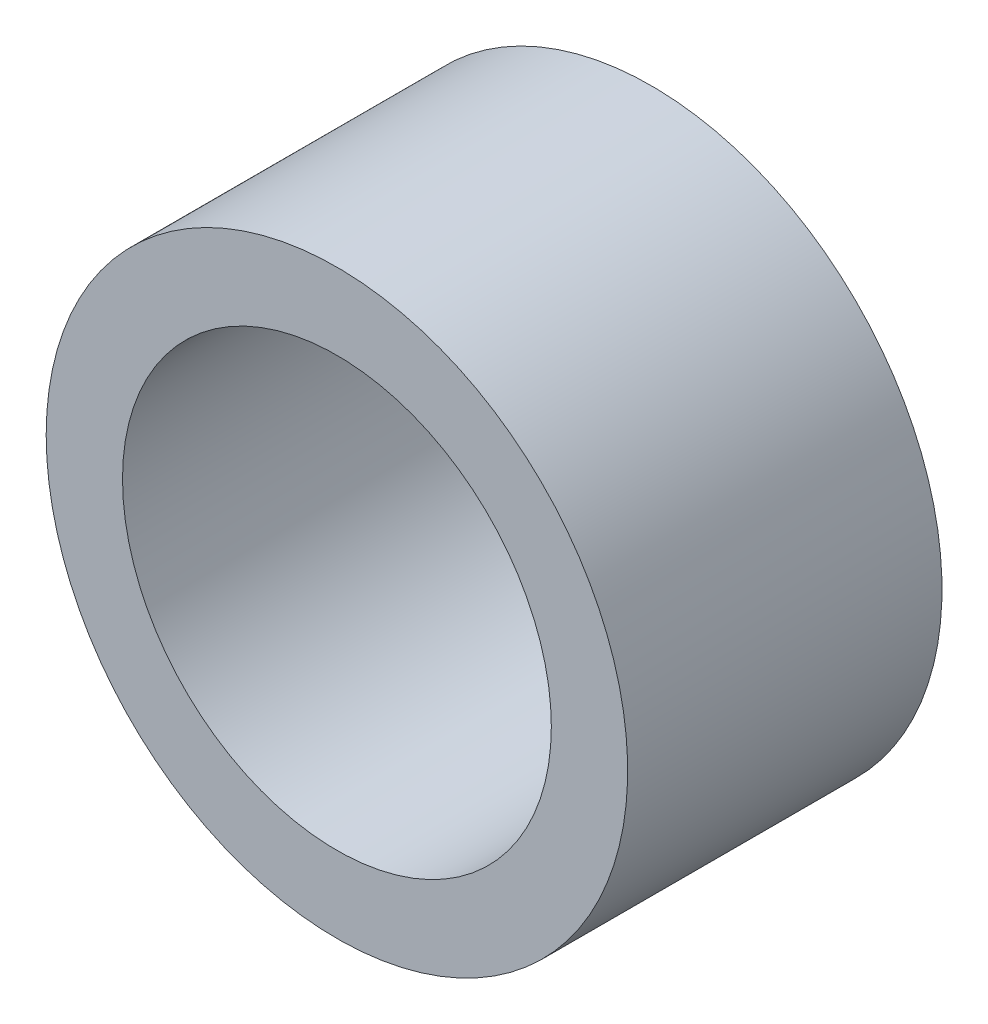
ISO-10303-21;
HEADER;
FILE_DESCRIPTION(('STEP AP214'),'2;1');
FILE_NAME('part.step','',(''),(''),'','','');
FILE_SCHEMA(('AUTOMOTIVE_DESIGN { 1 0 10303 214 1 1 1 1 }'));
ENDSEC;
DATA;
#1=APPLICATION_CONTEXT('core data for automotive mechanical design processes');
#2=APPLICATION_PROTOCOL_DEFINITION('international standard','automotive_design',2000,#1);
#3=PRODUCT_CONTEXT('',#1,'mechanical');
#4=PRODUCT('Part','Part','',(#3));
#5=PRODUCT_RELATED_PRODUCT_CATEGORY('part','',(#4));
#6=PRODUCT_DEFINITION_FORMATION('','',#4);
#7=PRODUCT_DEFINITION_CONTEXT('part definition',#1,'design');
#8=PRODUCT_DEFINITION('design','',#6,#7);
#9=PRODUCT_DEFINITION_SHAPE('','',#8);
#10=(LENGTH_UNIT() NAMED_UNIT(*) SI_UNIT(.MILLI.,.METRE.));
#11=(NAMED_UNIT(*) PLANE_ANGLE_UNIT() SI_UNIT($,.RADIAN.));
#12=(NAMED_UNIT(*) SI_UNIT($,.STERADIAN.) SOLID_ANGLE_UNIT());
#13=UNCERTAINTY_MEASURE_WITH_UNIT(LENGTH_MEASURE(1.E-05),#10,'distance_accuracy_value','');
#14=(GEOMETRIC_REPRESENTATION_CONTEXT(3) GLOBAL_UNCERTAINTY_ASSIGNED_CONTEXT((#13)) GLOBAL_UNIT_ASSIGNED_CONTEXT((#10,
#11,#12)) REPRESENTATION_CONTEXT('',''));
#15=CARTESIAN_POINT('',(0.,0.,0.));
#16=DIRECTION('',(0.,0.,1.));
#17=DIRECTION('',(1.,0.,0.));
#18=AXIS2_PLACEMENT_3D('',#15,#16,#17);
#19=CARTESIAN_POINT('',(0.,0.,7.112));
#20=DIRECTION('',(0.,0.,-1.));
#21=DIRECTION('',(-1.,0.,0.));
#22=AXIS2_PLACEMENT_3D('',#19,#20,#21);
#23=CYLINDRICAL_SURFACE('',#22,4.8514);
#24=CARTESIAN_POINT('',(0.,0.,0.));
#25=DIRECTION('',(0.,0.,-1.));
#26=DIRECTION('',(-1.,0.,0.));
#27=AXIS2_PLACEMENT_3D('',#24,#25,#26);
#28=CIRCLE('',#27,4.8514);
#29=CARTESIAN_POINT('',(-4.8514,0.,0.));
#30=VERTEX_POINT('',#29);
#31=EDGE_CURVE('E24',#30,#30,#28,.T.);
#32=ORIENTED_EDGE('',*,*,#31,.T.);
#33=EDGE_LOOP('',(#32));
#34=FACE_BOUND('',#33,.T.);
#35=CARTESIAN_POINT('',(0.,0.,7.112));
#36=DIRECTION('',(0.,0.,-1.));
#37=DIRECTION('',(-1.,0.,0.));
#38=AXIS2_PLACEMENT_3D('',#35,#36,#37);
#39=CIRCLE('',#38,4.8514);
#40=CARTESIAN_POINT('',(-4.8514,0.,7.112));
#41=VERTEX_POINT('',#40);
#42=EDGE_CURVE('E15',#41,#41,#39,.T.);
#43=ORIENTED_EDGE('',*,*,#42,.F.);
#44=EDGE_LOOP('',(#43));
#45=FACE_BOUND('',#44,.T.);
#46=ADVANCED_FACE('F12',(#34,#45),#23,.F.);
#47=CARTESIAN_POINT('',(0.,0.,7.112));
#48=DIRECTION('',(0.,0.,1.));
#49=DIRECTION('',(1.,0.,0.));
#50=AXIS2_PLACEMENT_3D('',#47,#48,#49);
#51=PLANE('',#50);
#52=ORIENTED_EDGE('',*,*,#42,.T.);
#53=EDGE_LOOP('',(#52));
#54=FACE_BOUND('',#53,.T.);
#55=CARTESIAN_POINT('',(0.,0.,7.112));
#56=DIRECTION('',(0.,0.,-1.));
#57=DIRECTION('',(-1.,0.,0.));
#58=AXIS2_PLACEMENT_3D('',#55,#56,#57);
#59=CIRCLE('',#58,6.5786);
#60=CARTESIAN_POINT('',(-6.5786,0.,7.112));
#61=VERTEX_POINT('',#60);
#62=EDGE_CURVE('E19',#61,#61,#59,.T.);
#63=ORIENTED_EDGE('',*,*,#62,.F.);
#64=EDGE_LOOP('',(#63));
#65=FACE_BOUND('',#64,.T.);
#66=ADVANCED_FACE('F32',(#54,#65),#51,.T.);
#67=CARTESIAN_POINT('',(0.,0.,0.));
#68=DIRECTION('',(0.,0.,1.));
#69=DIRECTION('',(1.,0.,0.));
#70=AXIS2_PLACEMENT_3D('',#67,#68,#69);
#71=PLANE('',#70);
#72=ORIENTED_EDGE('',*,*,#31,.F.);
#73=EDGE_LOOP('',(#72));
#74=FACE_BOUND('',#73,.T.);
#75=CARTESIAN_POINT('',(0.,0.,0.));
#76=DIRECTION('',(0.,0.,-1.));
#77=DIRECTION('',(-1.,0.,0.));
#78=AXIS2_PLACEMENT_3D('',#75,#76,#77);
#79=CIRCLE('',#78,6.5786);
#80=CARTESIAN_POINT('',(-6.5786,0.,0.));
#81=VERTEX_POINT('',#80);
#82=EDGE_CURVE('E8',#81,#81,#79,.F.);
#83=ORIENTED_EDGE('',*,*,#82,.F.);
#84=EDGE_LOOP('',(#83));
#85=FACE_BOUND('',#84,.T.);
#86=ADVANCED_FACE('F40',(#74,#85),#71,.F.);
#87=CARTESIAN_POINT('',(0.,0.,7.112));
#88=DIRECTION('',(0.,0.,-1.));
#89=DIRECTION('',(-1.,0.,0.));
#90=AXIS2_PLACEMENT_3D('',#87,#88,#89);
#91=CYLINDRICAL_SURFACE('',#90,6.5786);
#92=ORIENTED_EDGE('',*,*,#82,.T.);
#93=EDGE_LOOP('',(#92));
#94=FACE_BOUND('',#93,.T.);
#95=ORIENTED_EDGE('',*,*,#62,.T.);
#96=EDGE_LOOP('',(#95));
#97=FACE_BOUND('',#96,.T.);
#98=ADVANCED_FACE('F41',(#94,#97),#91,.T.);
#99=CLOSED_SHELL('',(#46,#66,#86,#98));
#100=MANIFOLD_SOLID_BREP('B1',#99);
#101=ADVANCED_BREP_SHAPE_REPRESENTATION('',(#18,#100),#14);
#102=SHAPE_DEFINITION_REPRESENTATION(#9,#101);
ENDSEC;
END-ISO-10303-21;
